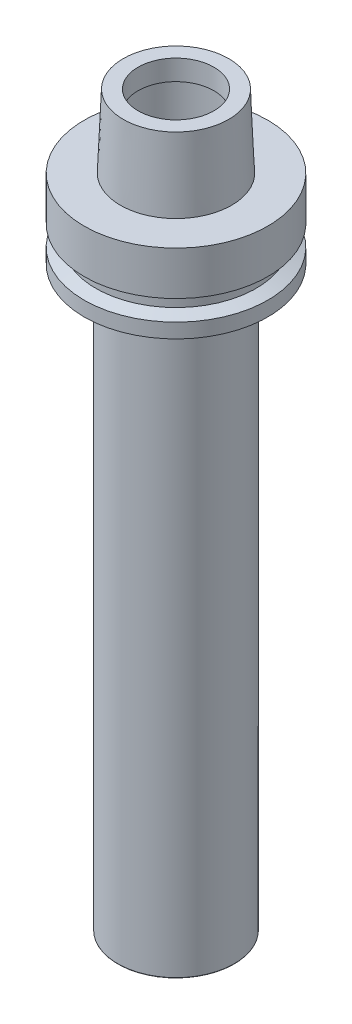
ISO-10303-21;
HEADER;
FILE_DESCRIPTION(('STEP AP214'),'2;1');
FILE_NAME('part.step','',(''),(''),'','','');
FILE_SCHEMA(('AUTOMOTIVE_DESIGN { 1 0 10303 214 1 1 1 1 }'));
ENDSEC;
DATA;
#1=APPLICATION_CONTEXT('core data for automotive mechanical design processes');
#2=APPLICATION_PROTOCOL_DEFINITION('international standard','automotive_design',2000,#1);
#3=PRODUCT_CONTEXT('',#1,'mechanical');
#4=PRODUCT('Part','Part','',(#3));
#5=PRODUCT_RELATED_PRODUCT_CATEGORY('part','',(#4));
#6=PRODUCT_DEFINITION_FORMATION('','',#4);
#7=PRODUCT_DEFINITION_CONTEXT('part definition',#1,'design');
#8=PRODUCT_DEFINITION('design','',#6,#7);
#9=PRODUCT_DEFINITION_SHAPE('','',#8);
#10=(LENGTH_UNIT() NAMED_UNIT(*) SI_UNIT(.MILLI.,.METRE.));
#11=(NAMED_UNIT(*) PLANE_ANGLE_UNIT() SI_UNIT($,.RADIAN.));
#12=(NAMED_UNIT(*) SI_UNIT($,.STERADIAN.) SOLID_ANGLE_UNIT());
#13=UNCERTAINTY_MEASURE_WITH_UNIT(LENGTH_MEASURE(1.E-05),#10,'distance_accuracy_value','');
#14=(GEOMETRIC_REPRESENTATION_CONTEXT(3) GLOBAL_UNCERTAINTY_ASSIGNED_CONTEXT((#13)) GLOBAL_UNIT_ASSIGNED_CONTEXT((#10,
#11,#12)) REPRESENTATION_CONTEXT('',''));
#15=CARTESIAN_POINT('',(0.,0.,0.));
#16=DIRECTION('',(0.,0.,1.));
#17=DIRECTION('',(1.,0.,0.));
#18=AXIS2_PLACEMENT_3D('',#15,#16,#17);
#19=CARTESIAN_POINT('',(0.,-209.,0.));
#20=DIRECTION('',(0.,-1.,0.));
#21=DIRECTION('',(0.,0.,-1.));
#22=AXIS2_PLACEMENT_3D('',#19,#20,#21);
#23=CYLINDRICAL_SURFACE('',#22,2.5);
#24=CARTESIAN_POINT('',(0.,-194.,0.));
#25=DIRECTION('',(0.,-1.,0.));
#26=DIRECTION('',(0.,0.,-1.));
#27=AXIS2_PLACEMENT_3D('',#24,#25,#26);
#28=CIRCLE('',#27,2.5);
#29=CARTESIAN_POINT('',(0.,-194.,-2.5));
#30=VERTEX_POINT('',#29);
#31=EDGE_CURVE('E10',#30,#30,#28,.T.);
#32=ORIENTED_EDGE('',*,*,#31,.F.);
#33=EDGE_LOOP('',(#32));
#34=FACE_BOUND('',#33,.T.);
#35=CARTESIAN_POINT('',(0.,-209.,0.));
#36=DIRECTION('',(0.,-1.,0.));
#37=DIRECTION('',(0.,0.,-1.));
#38=AXIS2_PLACEMENT_3D('',#35,#36,#37);
#39=CIRCLE('',#38,2.5);
#40=CARTESIAN_POINT('',(0.,-209.,-2.5));
#41=VERTEX_POINT('',#40);
#42=EDGE_CURVE('E115',#41,#41,#39,.T.);
#43=ORIENTED_EDGE('',*,*,#42,.T.);
#44=EDGE_LOOP('',(#43));
#45=FACE_BOUND('',#44,.T.);
#46=ADVANCED_FACE('F36',(#34,#45),#23,.F.);
#47=CARTESIAN_POINT('',(-2.5,-194.,0.));
#48=DIRECTION('',(0.,1.,0.));
#49=DIRECTION('',(0.,0.,1.));
#50=AXIS2_PLACEMENT_3D('',#47,#48,#49);
#51=PLANE('',#50);
#52=ORIENTED_EDGE('',*,*,#31,.T.);
#53=EDGE_LOOP('',(#52));
#54=FACE_BOUND('',#53,.T.);
#55=ADVANCED_FACE('F259',(#54),#51,.F.);
#56=CARTESIAN_POINT('',(-13.,9.29999999999992,0.));
#57=DIRECTION('',(0.,-1.,0.));
#58=DIRECTION('',(0.,0.,-1.));
#59=AXIS2_PLACEMENT_3D('',#56,#57,#58);
#60=PLANE('',#59);
#61=CARTESIAN_POINT('',(0.,9.29999999999992,0.));
#62=DIRECTION('',(0.,-1.,0.));
#63=DIRECTION('',(0.,0.,-1.));
#64=AXIS2_PLACEMENT_3D('',#61,#62,#63);
#65=CIRCLE('',#64,13.);
#66=CARTESIAN_POINT('',(0.,9.29999999999992,-13.));
#67=VERTEX_POINT('',#66);
#68=EDGE_CURVE('E42',#67,#67,#65,.T.);
#69=ORIENTED_EDGE('',*,*,#68,.F.);
#70=EDGE_LOOP('',(#69));
#71=FACE_BOUND('',#70,.T.);
#72=ADVANCED_FACE('F254',(#71),#60,.F.);
#73=CARTESIAN_POINT('',(0.,-209.,0.));
#74=DIRECTION('',(0.,-1.,0.));
#75=DIRECTION('',(0.,0.,-1.));
#76=AXIS2_PLACEMENT_3D('',#73,#74,#75);
#77=CYLINDRICAL_SURFACE('',#76,13.);
#78=CARTESIAN_POINT('',(0.,14.2999999999999,0.));
#79=DIRECTION('',(0.,-1.,0.));
#80=DIRECTION('',(0.,0.,-1.));
#81=AXIS2_PLACEMENT_3D('',#78,#79,#80);
#82=CIRCLE('',#81,13.);
#83=CARTESIAN_POINT('',(0.,14.2999999999999,-13.));
#84=VERTEX_POINT('',#83);
#85=EDGE_CURVE('E46',#84,#84,#82,.T.);
#86=ORIENTED_EDGE('',*,*,#85,.F.);
#87=EDGE_LOOP('',(#86));
#88=FACE_BOUND('',#87,.T.);
#89=ORIENTED_EDGE('',*,*,#68,.T.);
#90=EDGE_LOOP('',(#89));
#91=FACE_BOUND('',#90,.T.);
#92=ADVANCED_FACE('F249',(#88,#91),#77,.F.);
#93=CARTESIAN_POINT('',(-13.9999999999999,14.2999999999999,0.));
#94=DIRECTION('',(0.,-1.,0.));
#95=DIRECTION('',(0.,0.,-1.));
#96=AXIS2_PLACEMENT_3D('',#93,#94,#95);
#97=PLANE('',#96);
#98=CARTESIAN_POINT('',(0.,14.2999999999999,0.));
#99=DIRECTION('',(0.,-1.,0.));
#100=DIRECTION('',(0.,0.,-1.));
#101=AXIS2_PLACEMENT_3D('',#98,#99,#100);
#102=CIRCLE('',#101,13.9999999999999);
#103=CARTESIAN_POINT('',(0.,14.2999999999999,-13.9999999999999));
#104=VERTEX_POINT('',#103);
#105=EDGE_CURVE('E50',#104,#104,#102,.T.);
#106=ORIENTED_EDGE('',*,*,#105,.F.);
#107=EDGE_LOOP('',(#106));
#108=FACE_BOUND('',#107,.T.);
#109=ORIENTED_EDGE('',*,*,#85,.T.);
#110=EDGE_LOOP('',(#109));
#111=FACE_BOUND('',#110,.T.);
#112=ADVANCED_FACE('F243',(#108,#111),#97,.F.);
#113=CARTESIAN_POINT('',(0.,16.2999999999999,0.));
#114=DIRECTION('',(0.,-1.,0.));
#115=DIRECTION('',(0.,0.,-1.));
#116=AXIS2_PLACEMENT_3D('',#113,#114,#115);
#117=TOROIDAL_SURFACE('',#116,13.9999999999999,2.);
#118=CARTESIAN_POINT('',(0.,16.2999999999999,0.));
#119=DIRECTION('',(0.,-1.,0.));
#120=DIRECTION('',(0.,0.,-1.));
#121=AXIS2_PLACEMENT_3D('',#118,#119,#120);
#122=CIRCLE('',#121,15.9999999999999);
#123=CARTESIAN_POINT('',(0.,16.2999999999999,-15.9999999999999));
#124=VERTEX_POINT('',#123);
#125=EDGE_CURVE('E55',#124,#124,#122,.T.);
#126=ORIENTED_EDGE('',*,*,#125,.F.);
#127=EDGE_LOOP('',(#126));
#128=FACE_BOUND('',#127,.T.);
#129=ORIENTED_EDGE('',*,*,#105,.T.);
#130=EDGE_LOOP('',(#129));
#131=FACE_BOUND('',#130,.T.);
#132=ADVANCED_FACE('F237',(#128,#131),#117,.F.);
#133=CARTESIAN_POINT('',(0.,-209.,0.));
#134=DIRECTION('',(0.,-1.,0.));
#135=DIRECTION('',(0.,0.,-1.));
#136=AXIS2_PLACEMENT_3D('',#133,#134,#135);
#137=CYLINDRICAL_SURFACE('',#136,15.9999999999999);
#138=CARTESIAN_POINT('',(0.,34.2999999999999,0.));
#139=DIRECTION('',(0.,-1.,0.));
#140=DIRECTION('',(0.,0.,-1.));
#141=AXIS2_PLACEMENT_3D('',#138,#139,#140);
#142=CIRCLE('',#141,15.9999999999999);
#143=CARTESIAN_POINT('',(0.,34.2999999999999,-15.9999999999999));
#144=VERTEX_POINT('',#143);
#145=EDGE_CURVE('E58',#144,#144,#142,.T.);
#146=ORIENTED_EDGE('',*,*,#145,.F.);
#147=EDGE_LOOP('',(#146));
#148=FACE_BOUND('',#147,.T.);
#149=ORIENTED_EDGE('',*,*,#125,.T.);
#150=EDGE_LOOP('',(#149));
#151=FACE_BOUND('',#150,.T.);
#152=ADVANCED_FACE('F231',(#148,#151),#137,.F.);
#153=CARTESIAN_POINT('',(0.,34.2999999999999,0.));
#154=DIRECTION('',(0.,-1.,0.));
#155=DIRECTION('',(0.,0.,-1.));
#156=AXIS2_PLACEMENT_3D('',#153,#154,#155);
#157=TOROIDAL_SURFACE('',#156,13.9999999999999,2.);
#158=CARTESIAN_POINT('',(0.,36.2999999999999,0.));
#159=DIRECTION('',(0.,-1.,0.));
#160=DIRECTION('',(0.,0.,-1.));
#161=AXIS2_PLACEMENT_3D('',#158,#159,#160);
#162=CIRCLE('',#161,13.9999999999999);
#163=CARTESIAN_POINT('',(0.,36.2999999999999,-13.9999999999999));
#164=VERTEX_POINT('',#163);
#165=EDGE_CURVE('E61',#164,#164,#162,.T.);
#166=ORIENTED_EDGE('',*,*,#165,.F.);
#167=EDGE_LOOP('',(#166));
#168=FACE_BOUND('',#167,.T.);
#169=ORIENTED_EDGE('',*,*,#145,.T.);
#170=EDGE_LOOP('',(#169));
#171=FACE_BOUND('',#170,.T.);
#172=ADVANCED_FACE('F225',(#168,#171),#157,.F.);
#173=CARTESIAN_POINT('',(-13.,36.2999999999999,0.));
#174=DIRECTION('',(0.,1.,0.));
#175=DIRECTION('',(0.,0.,1.));
#176=AXIS2_PLACEMENT_3D('',#173,#174,#175);
#177=PLANE('',#176);
#178=CARTESIAN_POINT('',(0.,36.2999999999999,0.));
#179=DIRECTION('',(0.,-1.,0.));
#180=DIRECTION('',(0.,0.,-1.));
#181=AXIS2_PLACEMENT_3D('',#178,#179,#180);
#182=CIRCLE('',#181,13.);
#183=CARTESIAN_POINT('',(0.,36.2999999999999,-13.));
#184=VERTEX_POINT('',#183);
#185=EDGE_CURVE('E64',#184,#184,#182,.T.);
#186=ORIENTED_EDGE('',*,*,#185,.F.);
#187=EDGE_LOOP('',(#186));
#188=FACE_BOUND('',#187,.T.);
#189=ORIENTED_EDGE('',*,*,#165,.T.);
#190=EDGE_LOOP('',(#189));
#191=FACE_BOUND('',#190,.T.);
#192=ADVANCED_FACE('F219',(#188,#191),#177,.F.);
#193=CARTESIAN_POINT('',(0.,-209.,0.));
#194=DIRECTION('',(0.,-1.,0.));
#195=DIRECTION('',(0.,0.,-1.));
#196=AXIS2_PLACEMENT_3D('',#193,#194,#195);
#197=CYLINDRICAL_SURFACE('',#196,13.);
#198=CARTESIAN_POINT('',(0.,43.2999999999999,0.));
#199=DIRECTION('',(0.,-1.,0.));
#200=DIRECTION('',(0.,0.,-1.));
#201=AXIS2_PLACEMENT_3D('',#198,#199,#200);
#202=CIRCLE('',#201,12.9999999999999);
#203=CARTESIAN_POINT('',(0.,43.2999999999999,-12.9999999999999));
#204=VERTEX_POINT('',#203);
#205=EDGE_CURVE('E67',#204,#204,#202,.T.);
#206=ORIENTED_EDGE('',*,*,#205,.F.);
#207=EDGE_LOOP('',(#206));
#208=FACE_BOUND('',#207,.T.);
#209=ORIENTED_EDGE('',*,*,#185,.T.);
#210=EDGE_LOOP('',(#209));
#211=FACE_BOUND('',#210,.T.);
#212=ADVANCED_FACE('F213',(#208,#211),#197,.F.);
#213=CARTESIAN_POINT('',(-12.9999999999999,43.2999999999999,0.));
#214=DIRECTION('',(0.,-1.,0.));
#215=DIRECTION('',(0.,0.,-1.));
#216=AXIS2_PLACEMENT_3D('',#213,#214,#215);
#217=PLANE('',#216);
#218=CARTESIAN_POINT('',(0.,43.2999999999999,0.));
#219=DIRECTION('',(0.,-1.,0.));
#220=DIRECTION('',(0.,0.,-1.));
#221=AXIS2_PLACEMENT_3D('',#218,#219,#220);
#222=CIRCLE('',#221,18.085);
#223=CARTESIAN_POINT('',(0.,43.2999999999999,-18.085));
#224=VERTEX_POINT('',#223);
#225=EDGE_CURVE('E70',#224,#224,#222,.T.);
#226=ORIENTED_EDGE('',*,*,#225,.F.);
#227=EDGE_LOOP('',(#226));
#228=FACE_BOUND('',#227,.T.);
#229=ORIENTED_EDGE('',*,*,#205,.T.);
#230=EDGE_LOOP('',(#229));
#231=FACE_BOUND('',#230,.T.);
#232=ADVANCED_FACE('F207',(#228,#231),#217,.F.);
#233=CARTESIAN_POINT('',(0.,43.2999999999999,0.));
#234=DIRECTION('',(0.,-1.,0.));
#235=DIRECTION('',(0.,0.,-1.));
#236=AXIS2_PLACEMENT_3D('',#233,#234,#235);
#237=CONICAL_SURFACE('',#236,18.085,0.0405777142314997);
#238=CARTESIAN_POINT('',(0.,18.2999999999999,0.));
#239=DIRECTION('',(0.,-1.,0.));
#240=DIRECTION('',(0.,0.,-1.));
#241=AXIS2_PLACEMENT_3D('',#238,#239,#240);
#242=CIRCLE('',#241,19.1);
#243=CARTESIAN_POINT('',(0.,18.2999999999999,-19.1));
#244=VERTEX_POINT('',#243);
#245=EDGE_CURVE('E73',#244,#244,#242,.T.);
#246=ORIENTED_EDGE('',*,*,#245,.F.);
#247=EDGE_LOOP('',(#246));
#248=FACE_BOUND('',#247,.T.);
#249=ORIENTED_EDGE('',*,*,#225,.T.);
#250=EDGE_LOOP('',(#249));
#251=FACE_BOUND('',#250,.T.);
#252=ADVANCED_FACE('F201',(#248,#251),#237,.T.);
#253=CARTESIAN_POINT('',(-19.1,18.2999999999999,0.));
#254=DIRECTION('',(0.,-1.,0.));
#255=DIRECTION('',(0.,0.,-1.));
#256=AXIS2_PLACEMENT_3D('',#253,#254,#255);
#257=PLANE('',#256);
#258=CARTESIAN_POINT('',(0.,18.2999999999999,0.));
#259=DIRECTION('',(0.,-1.,0.));
#260=DIRECTION('',(0.,0.,-1.));
#261=AXIS2_PLACEMENT_3D('',#258,#259,#260);
#262=CIRCLE('',#261,31.5);
#263=CARTESIAN_POINT('',(0.,18.2999999999999,-31.5));
#264=VERTEX_POINT('',#263);
#265=EDGE_CURVE('E76',#264,#264,#262,.T.);
#266=ORIENTED_EDGE('',*,*,#265,.F.);
#267=EDGE_LOOP('',(#266));
#268=FACE_BOUND('',#267,.T.);
#269=ORIENTED_EDGE('',*,*,#245,.T.);
#270=EDGE_LOOP('',(#269));
#271=FACE_BOUND('',#270,.T.);
#272=ADVANCED_FACE('F195',(#268,#271),#257,.F.);
#273=CARTESIAN_POINT('',(0.,-209.,0.));
#274=DIRECTION('',(0.,-1.,0.));
#275=DIRECTION('',(0.,0.,-1.));
#276=AXIS2_PLACEMENT_3D('',#273,#274,#275);
#277=CYLINDRICAL_SURFACE('',#276,31.5);
#278=CARTESIAN_POINT('',(0.,3.29999999999991,0.));
#279=DIRECTION('',(0.,-1.,0.));
#280=DIRECTION('',(0.,0.,-1.));
#281=AXIS2_PLACEMENT_3D('',#278,#279,#280);
#282=CIRCLE('',#281,31.5);
#283=CARTESIAN_POINT('',(0.,3.29999999999991,-31.5));
#284=VERTEX_POINT('',#283);
#285=EDGE_CURVE('E79',#284,#284,#282,.T.);
#286=ORIENTED_EDGE('',*,*,#285,.F.);
#287=EDGE_LOOP('',(#286));
#288=FACE_BOUND('',#287,.T.);
#289=ORIENTED_EDGE('',*,*,#265,.T.);
#290=EDGE_LOOP('',(#289));
#291=FACE_BOUND('',#290,.T.);
#292=ADVANCED_FACE('F189',(#288,#291),#277,.T.);
#293=CARTESIAN_POINT('',(0.,3.29999999999991,0.));
#294=DIRECTION('',(0.,1.,0.));
#295=DIRECTION('',(0.,0.,1.));
#296=AXIS2_PLACEMENT_3D('',#293,#294,#295);
#297=CONICAL_SURFACE('',#296,31.5,1.21202565652432);
#298=CARTESIAN_POINT('',(0.,1.79999999999991,0.));
#299=DIRECTION('',(0.,-1.,0.));
#300=DIRECTION('',(0.,0.,-1.));
#301=AXIS2_PLACEMENT_3D('',#298,#299,#300);
#302=CIRCLE('',#301,27.5);
#303=CARTESIAN_POINT('',(0.,1.79999999999991,-27.5));
#304=VERTEX_POINT('',#303);
#305=EDGE_CURVE('E82',#304,#304,#302,.T.);
#306=ORIENTED_EDGE('',*,*,#305,.F.);
#307=EDGE_LOOP('',(#306));
#308=FACE_BOUND('',#307,.T.);
#309=ORIENTED_EDGE('',*,*,#285,.T.);
#310=EDGE_LOOP('',(#309));
#311=FACE_BOUND('',#310,.T.);
#312=ADVANCED_FACE('F183',(#308,#311),#297,.T.);
#313=CARTESIAN_POINT('',(0.,-209.,0.));
#314=DIRECTION('',(0.,-1.,0.));
#315=DIRECTION('',(0.,0.,-1.));
#316=AXIS2_PLACEMENT_3D('',#313,#314,#315);
#317=CYLINDRICAL_SURFACE('',#316,27.5);
#318=CARTESIAN_POINT('',(0.,-2.20000000000009,0.));
#319=DIRECTION('',(0.,-1.,0.));
#320=DIRECTION('',(0.,0.,-1.));
#321=AXIS2_PLACEMENT_3D('',#318,#319,#320);
#322=CIRCLE('',#321,27.5);
#323=CARTESIAN_POINT('',(0.,-2.20000000000009,-27.5));
#324=VERTEX_POINT('',#323);
#325=EDGE_CURVE('E85',#324,#324,#322,.T.);
#326=ORIENTED_EDGE('',*,*,#325,.F.);
#327=EDGE_LOOP('',(#326));
#328=FACE_BOUND('',#327,.T.);
#329=ORIENTED_EDGE('',*,*,#305,.T.);
#330=EDGE_LOOP('',(#329));
#331=FACE_BOUND('',#330,.T.);
#332=ADVANCED_FACE('F177',(#328,#331),#317,.T.);
#333=CARTESIAN_POINT('',(0.,-2.20000000000009,0.));
#334=DIRECTION('',(0.,-1.,0.));
#335=DIRECTION('',(0.,0.,-1.));
#336=AXIS2_PLACEMENT_3D('',#333,#334,#335);
#337=CONICAL_SURFACE('',#336,27.5,1.21202565652435);
#338=CARTESIAN_POINT('',(0.,-3.69999999999998,0.));
#339=DIRECTION('',(0.,-1.,0.));
#340=DIRECTION('',(0.,0.,-1.));
#341=AXIS2_PLACEMENT_3D('',#338,#339,#340);
#342=CIRCLE('',#341,31.5);
#343=CARTESIAN_POINT('',(0.,-3.69999999999998,-31.5));
#344=VERTEX_POINT('',#343);
#345=EDGE_CURVE('E88',#344,#344,#342,.T.);
#346=ORIENTED_EDGE('',*,*,#345,.F.);
#347=EDGE_LOOP('',(#346));
#348=FACE_BOUND('',#347,.T.);
#349=ORIENTED_EDGE('',*,*,#325,.T.);
#350=EDGE_LOOP('',(#349));
#351=FACE_BOUND('',#350,.T.);
#352=ADVANCED_FACE('F171',(#348,#351),#337,.T.);
#353=CARTESIAN_POINT('',(0.,-209.,0.));
#354=DIRECTION('',(0.,-1.,0.));
#355=DIRECTION('',(0.,0.,-1.));
#356=AXIS2_PLACEMENT_3D('',#353,#354,#355);
#357=CYLINDRICAL_SURFACE('',#356,31.5);
#358=CARTESIAN_POINT('',(0.,-8.69999999999999,0.));
#359=DIRECTION('',(0.,-1.,0.));
#360=DIRECTION('',(0.,0.,-1.));
#361=AXIS2_PLACEMENT_3D('',#358,#359,#360);
#362=CIRCLE('',#361,31.5);
#363=CARTESIAN_POINT('',(0.,-8.69999999999999,-31.5));
#364=VERTEX_POINT('',#363);
#365=EDGE_CURVE('E91',#364,#364,#362,.T.);
#366=ORIENTED_EDGE('',*,*,#365,.F.);
#367=EDGE_LOOP('',(#366));
#368=FACE_BOUND('',#367,.T.);
#369=ORIENTED_EDGE('',*,*,#345,.T.);
#370=EDGE_LOOP('',(#369));
#371=FACE_BOUND('',#370,.T.);
#372=ADVANCED_FACE('F165',(#368,#371),#357,.T.);
#373=CARTESIAN_POINT('',(-20.,-8.70000000000001,0.));
#374=DIRECTION('',(0.,1.,0.));
#375=DIRECTION('',(0.,0.,1.));
#376=AXIS2_PLACEMENT_3D('',#373,#374,#375);
#377=PLANE('',#376);
#378=CARTESIAN_POINT('',(0.,-8.70000000000001,0.));
#379=DIRECTION('',(0.,-1.,0.));
#380=DIRECTION('',(0.,0.,-1.));
#381=AXIS2_PLACEMENT_3D('',#378,#379,#380);
#382=CIRCLE('',#381,19.75);
#383=CARTESIAN_POINT('',(0.,-8.70000000000001,-19.75));
#384=VERTEX_POINT('',#383);
#385=EDGE_CURVE('E94',#384,#384,#382,.T.);
#386=ORIENTED_EDGE('',*,*,#385,.F.);
#387=EDGE_LOOP('',(#386));
#388=FACE_BOUND('',#387,.T.);
#389=ORIENTED_EDGE('',*,*,#365,.T.);
#390=EDGE_LOOP('',(#389));
#391=FACE_BOUND('',#390,.T.);
#392=ADVANCED_FACE('F159',(#388,#391),#377,.F.);
#393=CARTESIAN_POINT('',(0.,-8.94999999999999,0.));
#394=DIRECTION('',(0.,-1.,0.));
#395=DIRECTION('',(0.,0.,-1.));
#396=AXIS2_PLACEMENT_3D('',#393,#394,#395);
#397=TOROIDAL_SURFACE('',#396,19.75,0.249999999999985);
#398=CARTESIAN_POINT('',(0.,-8.94999999999999,0.));
#399=DIRECTION('',(0.,-1.,0.));
#400=DIRECTION('',(0.,0.,-1.));
#401=AXIS2_PLACEMENT_3D('',#398,#399,#400);
#402=CIRCLE('',#401,20.);
#403=CARTESIAN_POINT('',(0.,-8.94999999999999,-20.));
#404=VERTEX_POINT('',#403);
#405=EDGE_CURVE('E97',#404,#404,#402,.T.);
#406=ORIENTED_EDGE('',*,*,#405,.F.);
#407=EDGE_LOOP('',(#406));
#408=FACE_BOUND('',#407,.T.);
#409=ORIENTED_EDGE('',*,*,#385,.T.);
#410=EDGE_LOOP('',(#409));
#411=FACE_BOUND('',#410,.T.);
#412=ADVANCED_FACE('F153',(#408,#411),#397,.T.);
#413=CARTESIAN_POINT('',(0.,-209.,0.));
#414=DIRECTION('',(0.,-1.,0.));
#415=DIRECTION('',(0.,0.,-1.));
#416=AXIS2_PLACEMENT_3D('',#413,#414,#415);
#417=CYLINDRICAL_SURFACE('',#416,20.);
#418=CARTESIAN_POINT('',(0.,-206.555662432703,0.));
#419=DIRECTION('',(0.,-1.,0.));
#420=DIRECTION('',(0.,0.,-1.));
#421=AXIS2_PLACEMENT_3D('',#418,#419,#420);
#422=CIRCLE('',#421,20.);
#423=CARTESIAN_POINT('',(0.,-206.555662432703,-20.));
#424=VERTEX_POINT('',#423);
#425=EDGE_CURVE('E100',#424,#424,#422,.T.);
#426=ORIENTED_EDGE('',*,*,#425,.F.);
#427=EDGE_LOOP('',(#426));
#428=FACE_BOUND('',#427,.T.);
#429=ORIENTED_EDGE('',*,*,#405,.T.);
#430=EDGE_LOOP('',(#429));
#431=FACE_BOUND('',#430,.T.);
#432=ADVANCED_FACE('F147',(#428,#431),#417,.T.);
#433=CARTESIAN_POINT('',(0.,-206.555662432703,0.));
#434=DIRECTION('',(0.,-1.,0.));
#435=DIRECTION('',(0.,0.,-1.));
#436=AXIS2_PLACEMENT_3D('',#433,#434,#435);
#437=TOROIDAL_SURFACE('',#436,19.75,0.24999999999997);
#438=CARTESIAN_POINT('',(0.,-206.772168783649,0.));
#439=DIRECTION('',(0.,-1.,0.));
#440=DIRECTION('',(0.,0.,-1.));
#441=AXIS2_PLACEMENT_3D('',#438,#439,#440);
#442=CIRCLE('',#441,19.875);
#443=CARTESIAN_POINT('',(0.,-206.772168783649,-19.875));
#444=VERTEX_POINT('',#443);
#445=EDGE_CURVE('E103',#444,#444,#442,.T.);
#446=ORIENTED_EDGE('',*,*,#445,.F.);
#447=EDGE_LOOP('',(#446));
#448=FACE_BOUND('',#447,.T.);
#449=ORIENTED_EDGE('',*,*,#425,.T.);
#450=EDGE_LOOP('',(#449));
#451=FACE_BOUND('',#450,.T.);
#452=ADVANCED_FACE('F141',(#448,#451),#437,.T.);
#453=CARTESIAN_POINT('',(0.,-206.772168783649,0.));
#454=DIRECTION('',(0.,1.,0.));
#455=DIRECTION('',(0.,0.,1.));
#456=AXIS2_PLACEMENT_3D('',#453,#454,#455);
#457=CONICAL_SURFACE('',#456,19.875,1.0471975511966);
#458=CARTESIAN_POINT('',(0.,-209.2,0.));
#459=DIRECTION('',(0.,-1.,0.));
#460=DIRECTION('',(0.,0.,-1.));
#461=AXIS2_PLACEMENT_3D('',#458,#459,#460);
#462=CIRCLE('',#461,15.6698729810778);
#463=CARTESIAN_POINT('',(0.,-209.2,-15.6698729810778));
#464=VERTEX_POINT('',#463);
#465=EDGE_CURVE('E106',#464,#464,#462,.T.);
#466=ORIENTED_EDGE('',*,*,#465,.F.);
#467=EDGE_LOOP('',(#466));
#468=FACE_BOUND('',#467,.T.);
#469=ORIENTED_EDGE('',*,*,#445,.T.);
#470=EDGE_LOOP('',(#469));
#471=FACE_BOUND('',#470,.T.);
#472=ADVANCED_FACE('F135',(#468,#471),#457,.T.);
#473=CARTESIAN_POINT('',(-15.6698729810778,-209.2,0.));
#474=DIRECTION('',(0.,1.,0.));
#475=DIRECTION('',(0.,0.,1.));
#476=AXIS2_PLACEMENT_3D('',#473,#474,#475);
#477=PLANE('',#476);
#478=CARTESIAN_POINT('',(0.,-209.2,0.));
#479=DIRECTION('',(0.,-1.,0.));
#480=DIRECTION('',(0.,0.,-1.));
#481=AXIS2_PLACEMENT_3D('',#478,#479,#480);
#482=CIRCLE('',#481,13.5);
#483=CARTESIAN_POINT('',(0.,-209.2,-13.5));
#484=VERTEX_POINT('',#483);
#485=EDGE_CURVE('E109',#484,#484,#482,.T.);
#486=ORIENTED_EDGE('',*,*,#485,.F.);
#487=EDGE_LOOP('',(#486));
#488=FACE_BOUND('',#487,.T.);
#489=ORIENTED_EDGE('',*,*,#465,.T.);
#490=EDGE_LOOP('',(#489));
#491=FACE_BOUND('',#490,.T.);
#492=ADVANCED_FACE('F129',(#488,#491),#477,.F.);
#493=CARTESIAN_POINT('',(0.,-209.,0.));
#494=DIRECTION('',(0.,-1.,0.));
#495=DIRECTION('',(0.,0.,-1.));
#496=AXIS2_PLACEMENT_3D('',#493,#494,#495);
#497=CYLINDRICAL_SURFACE('',#496,13.5);
#498=CARTESIAN_POINT('',(0.,-209.,0.));
#499=DIRECTION('',(0.,-1.,0.));
#500=DIRECTION('',(0.,0.,-1.));
#501=AXIS2_PLACEMENT_3D('',#498,#499,#500);
#502=CIRCLE('',#501,13.5);
#503=CARTESIAN_POINT('',(0.,-209.,-13.5));
#504=VERTEX_POINT('',#503);
#505=EDGE_CURVE('E112',#504,#504,#502,.T.);
#506=ORIENTED_EDGE('',*,*,#505,.F.);
#507=EDGE_LOOP('',(#506));
#508=FACE_BOUND('',#507,.T.);
#509=ORIENTED_EDGE('',*,*,#485,.T.);
#510=EDGE_LOOP('',(#509));
#511=FACE_BOUND('',#510,.T.);
#512=ADVANCED_FACE('F123',(#508,#511),#497,.F.);
#513=CARTESIAN_POINT('',(-13.5,-209.,0.));
#514=DIRECTION('',(0.,1.,0.));
#515=DIRECTION('',(0.,0.,1.));
#516=AXIS2_PLACEMENT_3D('',#513,#514,#515);
#517=PLANE('',#516);
#518=ORIENTED_EDGE('',*,*,#42,.F.);
#519=EDGE_LOOP('',(#518));
#520=FACE_BOUND('',#519,.T.);
#521=ORIENTED_EDGE('',*,*,#505,.T.);
#522=EDGE_LOOP('',(#521));
#523=FACE_BOUND('',#522,.T.);
#524=ADVANCED_FACE('F120',(#520,#523),#517,.F.);
#525=CLOSED_SHELL('',(#46,#55,#72,#92,#112,#132,#152,#172,#192,#212,#232,#252,#272,#292,#312,
#332,#352,#372,#392,#412,#432,#452,#472,#492,#512,#524));
#526=MANIFOLD_SOLID_BREP('B2',#525);
#527=ADVANCED_BREP_SHAPE_REPRESENTATION('',(#18,#526),#14);
#528=SHAPE_DEFINITION_REPRESENTATION(#9,#527);
ENDSEC;
END-ISO-10303-21;
